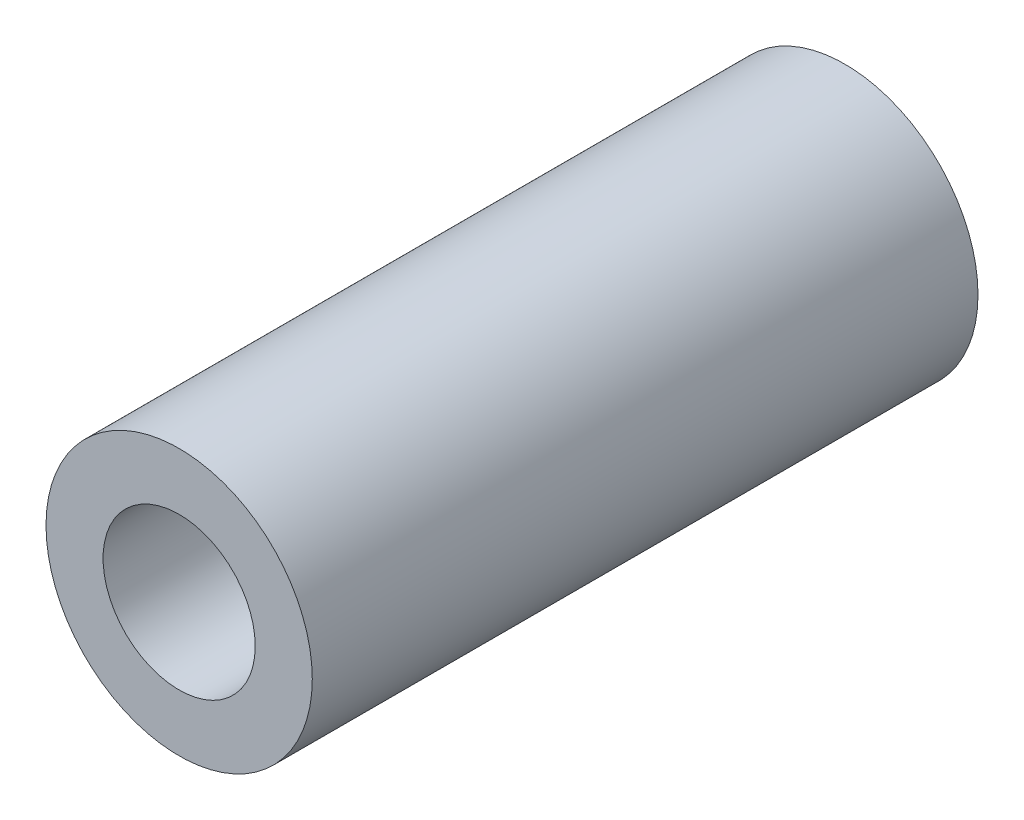
ISO-10303-21;
HEADER;
FILE_DESCRIPTION(('STEP AP214'),'2;1');
FILE_NAME('part.step','',(''),(''),'','','');
FILE_SCHEMA(('AUTOMOTIVE_DESIGN { 1 0 10303 214 1 1 1 1 }'));
ENDSEC;
DATA;
#1=APPLICATION_CONTEXT('core data for automotive mechanical design processes');
#2=APPLICATION_PROTOCOL_DEFINITION('international standard','automotive_design',2000,#1);
#3=PRODUCT_CONTEXT('',#1,'mechanical');
#4=PRODUCT('Part','Part','',(#3));
#5=PRODUCT_RELATED_PRODUCT_CATEGORY('part','',(#4));
#6=PRODUCT_DEFINITION_FORMATION('','',#4);
#7=PRODUCT_DEFINITION_CONTEXT('part definition',#1,'design');
#8=PRODUCT_DEFINITION('design','',#6,#7);
#9=PRODUCT_DEFINITION_SHAPE('','',#8);
#10=(LENGTH_UNIT() NAMED_UNIT(*) SI_UNIT(.MILLI.,.METRE.));
#11=(NAMED_UNIT(*) PLANE_ANGLE_UNIT() SI_UNIT($,.RADIAN.));
#12=(NAMED_UNIT(*) SI_UNIT($,.STERADIAN.) SOLID_ANGLE_UNIT());
#13=UNCERTAINTY_MEASURE_WITH_UNIT(LENGTH_MEASURE(1.E-05),#10,'distance_accuracy_value','');
#14=(GEOMETRIC_REPRESENTATION_CONTEXT(3) GLOBAL_UNCERTAINTY_ASSIGNED_CONTEXT((#13)) GLOBAL_UNIT_ASSIGNED_CONTEXT((#10,
#11,#12)) REPRESENTATION_CONTEXT('',''));
#15=CARTESIAN_POINT('',(0.,0.,0.));
#16=DIRECTION('',(0.,0.,1.));
#17=DIRECTION('',(1.,0.,0.));
#18=AXIS2_PLACEMENT_3D('',#15,#16,#17);
#19=CARTESIAN_POINT('',(0.,0.,35.));
#20=DIRECTION('',(0.,0.,1.));
#21=DIRECTION('',(1.,0.,0.));
#22=AXIS2_PLACEMENT_3D('',#19,#20,#21);
#23=PLANE('',#22);
#24=CARTESIAN_POINT('',(0.,0.,35.));
#25=DIRECTION('',(0.,0.,1.));
#26=DIRECTION('',(1.,0.,0.));
#27=AXIS2_PLACEMENT_3D('',#24,#25,#26);
#28=CIRCLE('',#27,7.);
#29=CARTESIAN_POINT('',(7.,0.,35.));
#30=VERTEX_POINT('',#29);
#31=EDGE_CURVE('E10',#30,#30,#28,.T.);
#32=ORIENTED_EDGE('',*,*,#31,.T.);
#33=EDGE_LOOP('',(#32));
#34=FACE_BOUND('',#33,.T.);
#35=CARTESIAN_POINT('',(0.,0.,35.));
#36=DIRECTION('',(0.,0.,1.));
#37=DIRECTION('',(1.,0.,0.));
#38=AXIS2_PLACEMENT_3D('',#35,#36,#37);
#39=CIRCLE('',#38,4.);
#40=CARTESIAN_POINT('',(4.,0.,35.));
#41=VERTEX_POINT('',#40);
#42=EDGE_CURVE('E50',#41,#41,#39,.T.);
#43=ORIENTED_EDGE('',*,*,#42,.F.);
#44=EDGE_LOOP('',(#43));
#45=FACE_BOUND('',#44,.T.);
#46=ADVANCED_FACE('F37',(#34,#45),#23,.T.);
#47=CARTESIAN_POINT('',(0.,0.,0.));
#48=DIRECTION('',(0.,0.,1.));
#49=DIRECTION('',(1.,0.,0.));
#50=AXIS2_PLACEMENT_3D('',#47,#48,#49);
#51=PLANE('',#50);
#52=CARTESIAN_POINT('',(0.,0.,0.));
#53=DIRECTION('',(0.,0.,1.));
#54=DIRECTION('',(1.,0.,0.));
#55=AXIS2_PLACEMENT_3D('',#52,#53,#54);
#56=CIRCLE('',#55,7.);
#57=CARTESIAN_POINT('',(7.,0.,0.));
#58=VERTEX_POINT('',#57);
#59=EDGE_CURVE('E41',#58,#58,#56,.T.);
#60=ORIENTED_EDGE('',*,*,#59,.F.);
#61=EDGE_LOOP('',(#60));
#62=FACE_BOUND('',#61,.T.);
#63=CARTESIAN_POINT('',(0.,0.,0.));
#64=DIRECTION('',(0.,0.,1.));
#65=DIRECTION('',(1.,0.,0.));
#66=AXIS2_PLACEMENT_3D('',#63,#64,#65);
#67=CIRCLE('',#66,4.);
#68=CARTESIAN_POINT('',(4.,0.,0.));
#69=VERTEX_POINT('',#68);
#70=EDGE_CURVE('E52',#69,#69,#67,.T.);
#71=ORIENTED_EDGE('',*,*,#70,.T.);
#72=EDGE_LOOP('',(#71));
#73=FACE_BOUND('',#72,.T.);
#74=ADVANCED_FACE('F64',(#62,#73),#51,.F.);
#75=CARTESIAN_POINT('',(0.,0.,35.));
#76=DIRECTION('',(0.,0.,-1.));
#77=DIRECTION('',(-1.,0.,0.));
#78=AXIS2_PLACEMENT_3D('',#75,#76,#77);
#79=CYLINDRICAL_SURFACE('',#78,7.);
#80=ORIENTED_EDGE('',*,*,#31,.F.);
#81=EDGE_LOOP('',(#80));
#82=FACE_BOUND('',#81,.T.);
#83=ORIENTED_EDGE('',*,*,#59,.T.);
#84=EDGE_LOOP('',(#83));
#85=FACE_BOUND('',#84,.T.);
#86=ADVANCED_FACE('F39',(#82,#85),#79,.T.);
#87=CARTESIAN_POINT('',(0.,0.,35.));
#88=DIRECTION('',(0.,0.,-1.));
#89=DIRECTION('',(-1.,0.,0.));
#90=AXIS2_PLACEMENT_3D('',#87,#88,#89);
#91=CYLINDRICAL_SURFACE('',#90,4.);
#92=ORIENTED_EDGE('',*,*,#42,.T.);
#93=EDGE_LOOP('',(#92));
#94=FACE_BOUND('',#93,.T.);
#95=ORIENTED_EDGE('',*,*,#70,.F.);
#96=EDGE_LOOP('',(#95));
#97=FACE_BOUND('',#96,.T.);
#98=ADVANCED_FACE('F60',(#94,#97),#91,.F.);
#99=CLOSED_SHELL('',(#46,#74,#86,#98));
#100=MANIFOLD_SOLID_BREP('B2',#99);
#101=ADVANCED_BREP_SHAPE_REPRESENTATION('',(#18,#100),#14);
#102=SHAPE_DEFINITION_REPRESENTATION(#9,#101);
ENDSEC;
END-ISO-10303-21;
